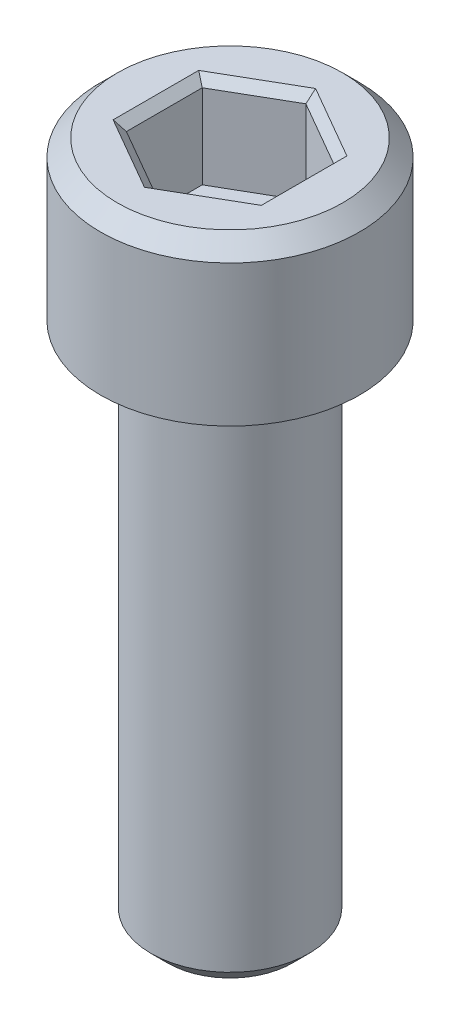
ISO-10303-21;
HEADER;
FILE_DESCRIPTION(('STEP AP214'),'2;1');
FILE_NAME('part.step','',(''),(''),'','','');
FILE_SCHEMA(('AUTOMOTIVE_DESIGN { 1 0 10303 214 1 1 1 1 }'));
ENDSEC;
DATA;
#1=APPLICATION_CONTEXT('core data for automotive mechanical design processes');
#2=APPLICATION_PROTOCOL_DEFINITION('international standard','automotive_design',2000,#1);
#3=PRODUCT_CONTEXT('',#1,'mechanical');
#4=PRODUCT('Part','Part','',(#3));
#5=PRODUCT_RELATED_PRODUCT_CATEGORY('part','',(#4));
#6=PRODUCT_DEFINITION_FORMATION('','',#4);
#7=PRODUCT_DEFINITION_CONTEXT('part definition',#1,'design');
#8=PRODUCT_DEFINITION('design','',#6,#7);
#9=PRODUCT_DEFINITION_SHAPE('','',#8);
#10=(LENGTH_UNIT() NAMED_UNIT(*) SI_UNIT(.MILLI.,.METRE.));
#11=(NAMED_UNIT(*) PLANE_ANGLE_UNIT() SI_UNIT($,.RADIAN.));
#12=(NAMED_UNIT(*) SI_UNIT($,.STERADIAN.) SOLID_ANGLE_UNIT());
#13=UNCERTAINTY_MEASURE_WITH_UNIT(LENGTH_MEASURE(1.E-05),#10,'distance_accuracy_value','');
#14=(GEOMETRIC_REPRESENTATION_CONTEXT(3) GLOBAL_UNCERTAINTY_ASSIGNED_CONTEXT((#13)) GLOBAL_UNIT_ASSIGNED_CONTEXT((#10,
#11,#12)) REPRESENTATION_CONTEXT('',''));
#15=CARTESIAN_POINT('',(0.,0.,0.));
#16=DIRECTION('',(0.,0.,1.));
#17=DIRECTION('',(1.,0.,0.));
#18=AXIS2_PLACEMENT_3D('',#15,#16,#17);
#19=CARTESIAN_POINT('',(-3.96874999999999,-2.79399999999996,0.));
#20=DIRECTION('',(0.,-1.,0.));
#21=DIRECTION('',(0.,0.,-1.));
#22=AXIS2_PLACEMENT_3D('',#19,#20,#21);
#23=PLANE('',#22);
#24=DIRECTION('',(-0.866025403784439,0.,0.5));
#25=VECTOR('',#24,1.);
#26=CARTESIAN_POINT('',(1.98437500000001,-2.79399999999996,1.14567944042317));
#27=LINE('',#26,#25);
#28=CARTESIAN_POINT('',(1.98437500000001,-2.79399999999996,1.14567944042317));
#29=VERTEX_POINT('',#28);
#30=CARTESIAN_POINT('',(0.,-2.79399999999996,2.29135888084634));
#31=VERTEX_POINT('',#30);
#32=EDGE_CURVE('E104',#29,#31,#27,.T.);
#33=ORIENTED_EDGE('',*,*,#32,.F.);
#34=DIRECTION('',(0.,0.,1.));
#35=VECTOR('',#34,1.);
#36=CARTESIAN_POINT('',(1.98437500000001,-2.79399999999996,-1.14567944042316));
#37=LINE('',#36,#35);
#38=CARTESIAN_POINT('',(1.98437500000001,-2.79399999999996,-1.14567944042316));
#39=VERTEX_POINT('',#38);
#40=EDGE_CURVE('E110',#39,#29,#37,.T.);
#41=ORIENTED_EDGE('',*,*,#40,.F.);
#42=DIRECTION('',(0.866025403784439,0.,0.5));
#43=VECTOR('',#42,1.);
#44=CARTESIAN_POINT('',(0.,-2.79399999999996,-2.29135888084632));
#45=LINE('',#44,#43);
#46=CARTESIAN_POINT('',(0.,-2.79399999999996,-2.29135888084632));
#47=VERTEX_POINT('',#46);
#48=EDGE_CURVE('E218',#47,#39,#45,.T.);
#49=ORIENTED_EDGE('',*,*,#48,.F.);
#50=DIRECTION('',(0.866025403784438,0.,-0.500000000000001));
#51=VECTOR('',#50,1.);
#52=CARTESIAN_POINT('',(-1.984375,-2.79399999999996,-1.14567944042316));
#53=LINE('',#52,#51);
#54=CARTESIAN_POINT('',(-1.984375,-2.79399999999996,-1.14567944042316));
#55=VERTEX_POINT('',#54);
#56=EDGE_CURVE('E227',#55,#47,#53,.T.);
#57=ORIENTED_EDGE('',*,*,#56,.F.);
#58=DIRECTION('',(0.,0.,-1.));
#59=VECTOR('',#58,1.);
#60=CARTESIAN_POINT('',(-1.984375,-2.79399999999996,1.14567944042317));
#61=LINE('',#60,#59);
#62=CARTESIAN_POINT('',(-1.984375,-2.79399999999996,1.14567944042317));
#63=VERTEX_POINT('',#62);
#64=EDGE_CURVE('E234',#63,#55,#61,.T.);
#65=ORIENTED_EDGE('',*,*,#64,.F.);
#66=DIRECTION('',(-0.866025403784438,0.,-0.5));
#67=VECTOR('',#66,1.);
#68=CARTESIAN_POINT('',(0.,-2.79399999999996,2.29135888084634));
#69=LINE('',#68,#67);
#70=EDGE_CURVE('E122',#31,#63,#69,.T.);
#71=ORIENTED_EDGE('',*,*,#70,.F.);
#72=EDGE_LOOP('',(#33,#41,#49,#57,#65,#71));
#73=FACE_BOUND('',#72,.T.);
#74=ADVANCED_FACE('F16',(#73),#23,.F.);
#75=CARTESIAN_POINT('',(1.98437500000001,-2.79399999999996,-1.14567944042316));
#76=DIRECTION('',(-1.,0.,0.));
#77=DIRECTION('',(0.,0.,1.));
#78=AXIS2_PLACEMENT_3D('',#75,#76,#77);
#79=PLANE('',#78);
#80=DIRECTION('',(0.,1.,0.));
#81=VECTOR('',#80,1.);
#82=CARTESIAN_POINT('',(1.98437500000001,-2.79399999999996,-1.14567944042315));
#83=LINE('',#82,#81);
#84=CARTESIAN_POINT('',(1.98437500000001,-0.25399999999998,-1.14567944042316));
#85=VERTEX_POINT('',#84);
#86=EDGE_CURVE('E115',#39,#85,#83,.T.);
#87=ORIENTED_EDGE('',*,*,#86,.F.);
#88=ORIENTED_EDGE('',*,*,#40,.T.);
#89=DIRECTION('',(0.,1.,0.));
#90=VECTOR('',#89,1.);
#91=CARTESIAN_POINT('',(1.98437500000001,-2.79399999999996,1.14567944042317));
#92=LINE('',#91,#90);
#93=CARTESIAN_POINT('',(1.98437500000001,-0.253999999999979,1.14567944042318));
#94=VERTEX_POINT('',#93);
#95=EDGE_CURVE('E112',#94,#29,#92,.F.);
#96=ORIENTED_EDGE('',*,*,#95,.F.);
#97=DIRECTION('',(0.,0.,1.));
#98=VECTOR('',#97,1.);
#99=CARTESIAN_POINT('',(1.98437500000002,-0.253999999999987,0.));
#100=LINE('',#99,#98);
#101=EDGE_CURVE('E215',#94,#85,#100,.F.);
#102=ORIENTED_EDGE('',*,*,#101,.T.);
#103=EDGE_LOOP('',(#87,#88,#96,#102));
#104=FACE_BOUND('',#103,.T.);
#105=ADVANCED_FACE('F111',(#104),#79,.T.);
#106=CARTESIAN_POINT('',(1.98437500000001,-2.79399999999996,1.14567944042317));
#107=DIRECTION('',(-0.5,0.,-0.866025403784439));
#108=DIRECTION('',(-0.866025403784439,0.,0.5));
#109=AXIS2_PLACEMENT_3D('',#106,#107,#108);
#110=PLANE('',#109);
#111=ORIENTED_EDGE('',*,*,#95,.T.);
#112=ORIENTED_EDGE('',*,*,#32,.T.);
#113=DIRECTION('',(0.,1.,0.));
#114=VECTOR('',#113,1.);
#115=CARTESIAN_POINT('',(0.,-2.79399999999996,2.29135888084634));
#116=LINE('',#115,#114);
#117=CARTESIAN_POINT('',(0.,-0.253999999999979,2.29135888084634));
#118=VERTEX_POINT('',#117);
#119=EDGE_CURVE('E125',#118,#31,#116,.F.);
#120=ORIENTED_EDGE('',*,*,#119,.F.);
#121=DIRECTION('',(0.866025403784439,0.,-0.5));
#122=VECTOR('',#121,1.);
#123=CARTESIAN_POINT('',(0.,-0.253999999999987,2.29135888084635));
#124=LINE('',#123,#122);
#125=EDGE_CURVE('E129',#118,#94,#124,.T.);
#126=ORIENTED_EDGE('',*,*,#125,.T.);
#127=EDGE_LOOP('',(#111,#112,#120,#126));
#128=FACE_BOUND('',#127,.T.);
#129=ADVANCED_FACE('F127',(#128),#110,.T.);
#130=CARTESIAN_POINT('',(0.,-2.79399999999996,2.29135888084634));
#131=DIRECTION('',(0.5,0.,-0.866025403784438));
#132=DIRECTION('',(-0.866025403784438,0.,-0.5));
#133=AXIS2_PLACEMENT_3D('',#130,#131,#132);
#134=PLANE('',#133);
#135=ORIENTED_EDGE('',*,*,#119,.T.);
#136=ORIENTED_EDGE('',*,*,#70,.T.);
#137=DIRECTION('',(0.,1.,0.));
#138=VECTOR('',#137,1.);
#139=CARTESIAN_POINT('',(-1.984375,-2.79399999999996,1.14567944042317));
#140=LINE('',#139,#138);
#141=CARTESIAN_POINT('',(-1.984375,-0.253999999999979,1.14567944042317));
#142=VERTEX_POINT('',#141);
#143=EDGE_CURVE('E237',#142,#63,#140,.F.);
#144=ORIENTED_EDGE('',*,*,#143,.F.);
#145=DIRECTION('',(0.866025403784438,0.,0.5));
#146=VECTOR('',#145,1.);
#147=CARTESIAN_POINT('',(-1.984375,-0.253999999999986,1.14567944042318));
#148=LINE('',#147,#146);
#149=EDGE_CURVE('E206',#142,#118,#148,.T.);
#150=ORIENTED_EDGE('',*,*,#149,.T.);
#151=EDGE_LOOP('',(#135,#136,#144,#150));
#152=FACE_BOUND('',#151,.T.);
#153=ADVANCED_FACE('F244',(#152),#134,.T.);
#154=CARTESIAN_POINT('',(-1.984375,-2.79399999999996,1.14567944042317));
#155=DIRECTION('',(1.,0.,0.));
#156=DIRECTION('',(0.,0.,-1.));
#157=AXIS2_PLACEMENT_3D('',#154,#155,#156);
#158=PLANE('',#157);
#159=ORIENTED_EDGE('',*,*,#143,.T.);
#160=ORIENTED_EDGE('',*,*,#64,.T.);
#161=DIRECTION('',(0.,1.,0.));
#162=VECTOR('',#161,1.);
#163=CARTESIAN_POINT('',(-1.984375,-2.79399999999996,-1.14567944042316));
#164=LINE('',#163,#162);
#165=CARTESIAN_POINT('',(-1.984375,-0.253999999999979,-1.14567944042316));
#166=VERTEX_POINT('',#165);
#167=EDGE_CURVE('E230',#166,#55,#164,.F.);
#168=ORIENTED_EDGE('',*,*,#167,.F.);
#169=DIRECTION('',(0.,0.,1.));
#170=VECTOR('',#169,1.);
#171=CARTESIAN_POINT('',(-1.98437500000001,-0.253999999999987,0.));
#172=LINE('',#171,#170);
#173=EDGE_CURVE('E199',#166,#142,#172,.T.);
#174=ORIENTED_EDGE('',*,*,#173,.T.);
#175=EDGE_LOOP('',(#159,#160,#168,#174));
#176=FACE_BOUND('',#175,.T.);
#177=ADVANCED_FACE('F274',(#176),#158,.T.);
#178=CARTESIAN_POINT('',(-1.984375,-2.79399999999996,-1.14567944042316));
#179=DIRECTION('',(0.500000000000001,0.,0.866025403784438));
#180=DIRECTION('',(0.866025403784438,0.,-0.500000000000001));
#181=AXIS2_PLACEMENT_3D('',#178,#179,#180);
#182=PLANE('',#181);
#183=ORIENTED_EDGE('',*,*,#167,.T.);
#184=ORIENTED_EDGE('',*,*,#56,.T.);
#185=DIRECTION('',(0.,1.,0.));
#186=VECTOR('',#185,1.);
#187=CARTESIAN_POINT('',(0.,-2.79399999999996,-2.29135888084632));
#188=LINE('',#187,#186);
#189=CARTESIAN_POINT('',(0.,-0.253999999999979,-2.29135888084633));
#190=VERTEX_POINT('',#189);
#191=EDGE_CURVE('E221',#190,#47,#188,.F.);
#192=ORIENTED_EDGE('',*,*,#191,.F.);
#193=DIRECTION('',(-0.866025403784439,0.,0.499999999999999));
#194=VECTOR('',#193,1.);
#195=CARTESIAN_POINT('',(0.,-0.25399999999999,-2.29135888084633));
#196=LINE('',#195,#194);
#197=EDGE_CURVE('E192',#190,#166,#196,.T.);
#198=ORIENTED_EDGE('',*,*,#197,.T.);
#199=EDGE_LOOP('',(#183,#184,#192,#198));
#200=FACE_BOUND('',#199,.T.);
#201=ADVANCED_FACE('F270',(#200),#182,.T.);
#202=CARTESIAN_POINT('',(0.,-2.79399999999996,-2.29135888084632));
#203=DIRECTION('',(-0.5,0.,0.866025403784439));
#204=DIRECTION('',(0.866025403784439,0.,0.5));
#205=AXIS2_PLACEMENT_3D('',#202,#203,#204);
#206=PLANE('',#205);
#207=ORIENTED_EDGE('',*,*,#191,.T.);
#208=ORIENTED_EDGE('',*,*,#48,.T.);
#209=ORIENTED_EDGE('',*,*,#86,.T.);
#210=DIRECTION('',(-0.866025403784439,0.,-0.499999999999999));
#211=VECTOR('',#210,1.);
#212=CARTESIAN_POINT('',(1.98437500000001,-0.253999999999985,-1.14567944042317));
#213=LINE('',#212,#211);
#214=EDGE_CURVE('E181',#85,#190,#213,.T.);
#215=ORIENTED_EDGE('',*,*,#214,.T.);
#216=EDGE_LOOP('',(#207,#208,#209,#215));
#217=FACE_BOUND('',#216,.T.);
#218=ADVANCED_FACE('F265',(#217),#206,.T.);
#219=CARTESIAN_POINT('',(2.23837500000001,0.,0.));
#220=DIRECTION('',(0.707106781186548,-0.707106781186548,0.));
#221=DIRECTION('',(0.707106781186548,0.707106781186548,0.));
#222=AXIS2_PLACEMENT_3D('',#219,#220,#221);
#223=PLANE('',#222);
#224=ORIENTED_EDGE('',*,*,#101,.F.);
#225=DIRECTION('',(0.654653670707993,0.654653670707971,0.377964473009212));
#226=VECTOR('',#225,1.);
#227=CARTESIAN_POINT('',(1.98437500000002,-0.253999999999987,1.14567944042318));
#228=LINE('',#227,#226);
#229=CARTESIAN_POINT('',(2.23837500000001,0.,1.29232640879733));
#230=VERTEX_POINT('',#229);
#231=EDGE_CURVE('E210',#94,#230,#228,.T.);
#232=ORIENTED_EDGE('',*,*,#231,.T.);
#233=DIRECTION('',(0.,0.,1.));
#234=VECTOR('',#233,1.);
#235=CARTESIAN_POINT('',(2.23837500000001,0.,0.));
#236=LINE('',#235,#234);
#237=CARTESIAN_POINT('',(2.23837500000001,0.,-1.29232640879732));
#238=VERTEX_POINT('',#237);
#239=EDGE_CURVE('E176',#238,#230,#236,.T.);
#240=ORIENTED_EDGE('',*,*,#239,.F.);
#241=DIRECTION('',(-0.654653670707993,-0.65465367070797,0.377964473009211));
#242=VECTOR('',#241,1.);
#243=CARTESIAN_POINT('',(2.23837500000001,0.,-1.29232640879732));
#244=LINE('',#243,#242);
#245=EDGE_CURVE('E185',#238,#85,#244,.T.);
#246=ORIENTED_EDGE('',*,*,#245,.T.);
#247=EDGE_LOOP('',(#224,#232,#240,#246));
#248=FACE_BOUND('',#247,.T.);
#249=ADVANCED_FACE('F260',(#248),#223,.F.);
#250=CARTESIAN_POINT('',(1.11918750000001,0.,1.938489613196));
#251=DIRECTION('',(0.353553390593273,-0.707106781186548,0.612372435695794));
#252=DIRECTION('',(0.,-0.654653670707977,-0.755928946018455));
#253=AXIS2_PLACEMENT_3D('',#250,#251,#252);
#254=PLANE('',#253);
#255=ORIENTED_EDGE('',*,*,#125,.F.);
#256=DIRECTION('',(0.,-0.654653670707977,-0.755928946018455));
#257=VECTOR('',#256,1.);
#258=CARTESIAN_POINT('',(0.,-0.319767857142858,2.21541670079542));
#259=LINE('',#258,#257);
#260=CARTESIAN_POINT('',(0.,0.,2.58465281759466));
#261=VERTEX_POINT('',#260);
#262=EDGE_CURVE('E203',#118,#261,#259,.F.);
#263=ORIENTED_EDGE('',*,*,#262,.T.);
#264=DIRECTION('',(-0.866025403784438,0.,0.500000000000001));
#265=VECTOR('',#264,1.);
#266=CARTESIAN_POINT('',(2.23837500000001,0.,1.29232640879733));
#267=LINE('',#266,#265);
#268=EDGE_CURVE('E172',#230,#261,#267,.T.);
#269=ORIENTED_EDGE('',*,*,#268,.F.);
#270=ORIENTED_EDGE('',*,*,#231,.F.);
#271=EDGE_LOOP('',(#255,#263,#269,#270));
#272=FACE_BOUND('',#271,.T.);
#273=ADVANCED_FACE('F251',(#272),#254,.F.);
#274=CARTESIAN_POINT('',(-1.1191875,0.,1.938489613196));
#275=DIRECTION('',(-0.353553390593274,-0.707106781186548,0.612372435695794));
#276=DIRECTION('',(0.,-0.654653670707977,-0.755928946018455));
#277=AXIS2_PLACEMENT_3D('',#274,#275,#276);
#278=PLANE('',#277);
#279=DIRECTION('',(-0.866025403784438,0.,-0.500000000000001));
#280=VECTOR('',#279,1.);
#281=CARTESIAN_POINT('',(0.,0.,2.58465281759467));
#282=LINE('',#281,#280);
#283=CARTESIAN_POINT('',(-2.23837499999999,0.,1.29232640879733));
#284=VERTEX_POINT('',#283);
#285=EDGE_CURVE('E168',#261,#284,#282,.T.);
#286=ORIENTED_EDGE('',*,*,#285,.F.);
#287=ORIENTED_EDGE('',*,*,#262,.F.);
#288=ORIENTED_EDGE('',*,*,#149,.F.);
#289=DIRECTION('',(-0.654653670707976,0.654653670707976,0.377964473009231));
#290=VECTOR('',#289,1.);
#291=CARTESIAN_POINT('',(-1.98437500000001,-0.253999999999987,1.14567944042317));
#292=LINE('',#291,#290);
#293=EDGE_CURVE('E196',#142,#284,#292,.T.);
#294=ORIENTED_EDGE('',*,*,#293,.T.);
#295=EDGE_LOOP('',(#286,#287,#288,#294));
#296=FACE_BOUND('',#295,.T.);
#297=ADVANCED_FACE('F254',(#296),#278,.F.);
#298=CARTESIAN_POINT('',(-2.23837499999999,0.,0.));
#299=DIRECTION('',(-0.707106781186548,-0.707106781186548,0.));
#300=DIRECTION('',(0.707106781186548,-0.707106781186548,0.));
#301=AXIS2_PLACEMENT_3D('',#298,#299,#300);
#302=PLANE('',#301);
#303=DIRECTION('',(0.,0.,1.));
#304=VECTOR('',#303,1.);
#305=CARTESIAN_POINT('',(-2.23837499999999,0.,0.));
#306=LINE('',#305,#304);
#307=CARTESIAN_POINT('',(-2.23837499999999,0.,-1.29232640879732));
#308=VERTEX_POINT('',#307);
#309=EDGE_CURVE('E165',#284,#308,#306,.F.);
#310=ORIENTED_EDGE('',*,*,#309,.F.);
#311=ORIENTED_EDGE('',*,*,#293,.F.);
#312=ORIENTED_EDGE('',*,*,#173,.F.);
#313=DIRECTION('',(-0.654653670707992,0.654653670707971,-0.377964473009212));
#314=VECTOR('',#313,1.);
#315=CARTESIAN_POINT('',(-1.984375,-0.253999999999987,-1.14567944042317));
#316=LINE('',#315,#314);
#317=EDGE_CURVE('E189',#166,#308,#316,.T.);
#318=ORIENTED_EDGE('',*,*,#317,.T.);
#319=EDGE_LOOP('',(#310,#311,#312,#318));
#320=FACE_BOUND('',#319,.T.);
#321=ADVANCED_FACE('F272',(#320),#302,.F.);
#322=CARTESIAN_POINT('',(-1.11918749999999,0.,-1.93848961319599));
#323=DIRECTION('',(-0.353553390593274,-0.707106781186548,-0.612372435695794));
#324=DIRECTION('',(0.,0.654653670707977,-0.755928946018455));
#325=AXIS2_PLACEMENT_3D('',#322,#323,#324);
#326=PLANE('',#325);
#327=ORIENTED_EDGE('',*,*,#197,.F.);
#328=DIRECTION('',(0.,0.654653670707977,-0.755928946018455));
#329=VECTOR('',#328,1.);
#330=CARTESIAN_POINT('',(0.,-0.319767857142854,-2.21541670079541));
#331=LINE('',#330,#329);
#332=CARTESIAN_POINT('',(0.,0.,-2.58465281759465));
#333=VERTEX_POINT('',#332);
#334=EDGE_CURVE('E39',#190,#333,#331,.T.);
#335=ORIENTED_EDGE('',*,*,#334,.T.);
#336=DIRECTION('',(0.866025403784438,0.,-0.500000000000001));
#337=VECTOR('',#336,1.);
#338=CARTESIAN_POINT('',(-2.23837499999999,0.,-1.29232640879732));
#339=LINE('',#338,#337);
#340=EDGE_CURVE('E161',#308,#333,#339,.T.);
#341=ORIENTED_EDGE('',*,*,#340,.F.);
#342=ORIENTED_EDGE('',*,*,#317,.F.);
#343=EDGE_LOOP('',(#327,#335,#341,#342));
#344=FACE_BOUND('',#343,.T.);
#345=ADVANCED_FACE('F267',(#344),#326,.F.);
#346=CARTESIAN_POINT('',(1.1191875,0.,-1.93848961319599));
#347=DIRECTION('',(0.353553390593274,-0.707106781186548,-0.612372435695794));
#348=DIRECTION('',(0.,0.654653670707977,-0.755928946018455));
#349=AXIS2_PLACEMENT_3D('',#346,#347,#348);
#350=PLANE('',#349);
#351=ORIENTED_EDGE('',*,*,#214,.F.);
#352=ORIENTED_EDGE('',*,*,#245,.F.);
#353=DIRECTION('',(0.866025403784438,0.,0.500000000000001));
#354=VECTOR('',#353,1.);
#355=CARTESIAN_POINT('',(0.,0.,-2.58465281759465));
#356=LINE('',#355,#354);
#357=EDGE_CURVE('E155',#333,#238,#356,.T.);
#358=ORIENTED_EDGE('',*,*,#357,.F.);
#359=ORIENTED_EDGE('',*,*,#334,.F.);
#360=EDGE_LOOP('',(#351,#352,#358,#359));
#361=FACE_BOUND('',#360,.T.);
#362=ADVANCED_FACE('F263',(#361),#350,.F.);
#363=CARTESIAN_POINT('',(0.,0.,0.));
#364=DIRECTION('',(0.,1.,0.));
#365=DIRECTION('',(0.,0.,1.));
#366=AXIS2_PLACEMENT_3D('',#363,#364,#365);
#367=PLANE('',#366);
#368=CARTESIAN_POINT('',(0.,-5.6843418860808E-11,0.));
#369=DIRECTION('',(0.,-1.,0.));
#370=DIRECTION('',(0.,0.,-1.));
#371=AXIS2_PLACEMENT_3D('',#368,#369,#370);
#372=CIRCLE('',#371,3.40360000001283);
#373=CARTESIAN_POINT('',(0.,-5.6843418860808E-11,-3.40360000001283));
#374=VERTEX_POINT('',#373);
#375=EDGE_CURVE('E19',#374,#374,#372,.T.);
#376=ORIENTED_EDGE('',*,*,#375,.F.);
#377=EDGE_LOOP('',(#376));
#378=FACE_BOUND('',#377,.T.);
#379=ORIENTED_EDGE('',*,*,#340,.T.);
#380=ORIENTED_EDGE('',*,*,#357,.T.);
#381=ORIENTED_EDGE('',*,*,#239,.T.);
#382=ORIENTED_EDGE('',*,*,#268,.T.);
#383=ORIENTED_EDGE('',*,*,#285,.T.);
#384=ORIENTED_EDGE('',*,*,#309,.T.);
#385=EDGE_LOOP('',(#379,#380,#381,#382,#383,#384));
#386=FACE_BOUND('',#385,.T.);
#387=ADVANCED_FACE('F257',(#378,#386),#367,.T.);
#388=CARTESIAN_POINT('',(0.,-0.507999999911135,0.));
#389=DIRECTION('',(0.,-1.,0.));
#390=DIRECTION('',(0.,0.,-1.));
#391=AXIS2_PLACEMENT_3D('',#388,#389,#390);
#392=CONICAL_SURFACE('',#391,3.91159999986712,0.785398163397448);
#393=CARTESIAN_POINT('',(0.,-0.507999999999953,0.));
#394=DIRECTION('',(0.,1.,0.));
#395=DIRECTION('',(0.,0.,1.));
#396=AXIS2_PLACEMENT_3D('',#393,#394,#395);
#397=CIRCLE('',#396,3.9116);
#398=CARTESIAN_POINT('',(0.,-0.507999999999953,3.9116));
#399=VERTEX_POINT('',#398);
#400=EDGE_CURVE('E143',#399,#399,#397,.F.);
#401=ORIENTED_EDGE('',*,*,#400,.F.);
#402=EDGE_LOOP('',(#401));
#403=FACE_BOUND('',#402,.T.);
#404=ORIENTED_EDGE('',*,*,#375,.T.);
#405=EDGE_LOOP('',(#404));
#406=FACE_BOUND('',#405,.T.);
#407=ADVANCED_FACE('F307',(#403,#406),#392,.T.);
#408=CARTESIAN_POINT('',(0.,-20.6502,0.));
#409=DIRECTION('',(0.,1.,0.));
#410=DIRECTION('',(0.,0.,1.));
#411=AXIS2_PLACEMENT_3D('',#408,#409,#410);
#412=PLANE('',#411);
#413=CARTESIAN_POINT('',(0.,-20.6502000000341,0.));
#414=DIRECTION('',(0.,1.,0.));
#415=DIRECTION('',(0.,0.,1.));
#416=AXIS2_PLACEMENT_3D('',#413,#414,#415);
#417=CIRCLE('',#416,1.87959999993836);
#418=CARTESIAN_POINT('',(0.,-20.6502000000341,1.87959999993836));
#419=VERTEX_POINT('',#418);
#420=EDGE_CURVE('E140',#419,#419,#417,.T.);
#421=ORIENTED_EDGE('',*,*,#420,.F.);
#422=EDGE_LOOP('',(#421));
#423=FACE_BOUND('',#422,.T.);
#424=ADVANCED_FACE('F304',(#423),#412,.F.);
#425=CARTESIAN_POINT('',(0.,-4.77520000000009,0.));
#426=DIRECTION('',(0.,1.,0.));
#427=DIRECTION('',(0.,0.,1.));
#428=AXIS2_PLACEMENT_3D('',#425,#426,#427);
#429=CYLINDRICAL_SURFACE('',#428,3.9116);
#430=ORIENTED_EDGE('',*,*,#400,.T.);
#431=EDGE_LOOP('',(#430));
#432=FACE_BOUND('',#431,.T.);
#433=CARTESIAN_POINT('',(0.,-4.77520000000009,0.));
#434=DIRECTION('',(0.,1.,0.));
#435=DIRECTION('',(0.,0.,1.));
#436=AXIS2_PLACEMENT_3D('',#433,#434,#435);
#437=CIRCLE('',#436,3.9116);
#438=CARTESIAN_POINT('',(0.,-4.77520000000009,3.9116));
#439=VERTEX_POINT('',#438);
#440=EDGE_CURVE('E137',#439,#439,#437,.T.);
#441=ORIENTED_EDGE('',*,*,#440,.T.);
#442=EDGE_LOOP('',(#441));
#443=FACE_BOUND('',#442,.T.);
#444=ADVANCED_FACE('F300',(#432,#443),#429,.T.);
#445=CARTESIAN_POINT('',(0.,-20.1421999998956,0.));
#446=DIRECTION('',(0.,1.,0.));
#447=DIRECTION('',(0.,0.,1.));
#448=AXIS2_PLACEMENT_3D('',#445,#446,#447);
#449=CONICAL_SURFACE('',#448,2.38760000007687,0.785398163397448);
#450=CARTESIAN_POINT('',(0.,-20.1422,0.));
#451=DIRECTION('',(0.,1.,0.));
#452=DIRECTION('',(0.,0.,1.));
#453=AXIS2_PLACEMENT_3D('',#450,#451,#452);
#454=CIRCLE('',#453,2.3876);
#455=CARTESIAN_POINT('',(0.,-20.1422,2.3876));
#456=VERTEX_POINT('',#455);
#457=EDGE_CURVE('E26',#456,#456,#454,.T.);
#458=ORIENTED_EDGE('',*,*,#457,.F.);
#459=EDGE_LOOP('',(#458));
#460=FACE_BOUND('',#459,.T.);
#461=ORIENTED_EDGE('',*,*,#420,.T.);
#462=EDGE_LOOP('',(#461));
#463=FACE_BOUND('',#462,.T.);
#464=ADVANCED_FACE('F293',(#460,#463),#449,.T.);
#465=CARTESIAN_POINT('',(0.,-4.77520000000009,0.));
#466=DIRECTION('',(0.,1.,0.));
#467=DIRECTION('',(0.,0.,1.));
#468=AXIS2_PLACEMENT_3D('',#465,#466,#467);
#469=PLANE('',#468);
#470=ORIENTED_EDGE('',*,*,#440,.F.);
#471=EDGE_LOOP('',(#470));
#472=FACE_BOUND('',#471,.T.);
#473=CARTESIAN_POINT('',(0.,-4.77520000000009,0.));
#474=DIRECTION('',(0.,1.,0.));
#475=DIRECTION('',(0.,0.,1.));
#476=AXIS2_PLACEMENT_3D('',#473,#474,#475);
#477=CIRCLE('',#476,2.3876);
#478=CARTESIAN_POINT('',(0.,-4.77520000000009,2.3876));
#479=VERTEX_POINT('',#478);
#480=EDGE_CURVE('E11',#479,#479,#477,.F.);
#481=ORIENTED_EDGE('',*,*,#480,.F.);
#482=EDGE_LOOP('',(#481));
#483=FACE_BOUND('',#482,.T.);
#484=ADVANCED_FACE('F287',(#472,#483),#469,.F.);
#485=CARTESIAN_POINT('',(0.,-20.6502,0.));
#486=DIRECTION('',(0.,1.,0.));
#487=DIRECTION('',(0.,0.,1.));
#488=AXIS2_PLACEMENT_3D('',#485,#486,#487);
#489=CYLINDRICAL_SURFACE('',#488,2.3876);
#490=ORIENTED_EDGE('',*,*,#480,.T.);
#491=EDGE_LOOP('',(#490));
#492=FACE_BOUND('',#491,.T.);
#493=ORIENTED_EDGE('',*,*,#457,.T.);
#494=EDGE_LOOP('',(#493));
#495=FACE_BOUND('',#494,.T.);
#496=ADVANCED_FACE('F285',(#492,#495),#489,.T.);
#497=CLOSED_SHELL('',(#74,#105,#129,#153,#177,#201,#218,#249,#273,#297,#321,#345,#362,#387,#407,
#424,#444,#464,#484,#496));
#498=MANIFOLD_SOLID_BREP('B1',#497);
#499=ADVANCED_BREP_SHAPE_REPRESENTATION('',(#18,#498),#14);
#500=SHAPE_DEFINITION_REPRESENTATION(#9,#499);
ENDSEC;
END-ISO-10303-21;
